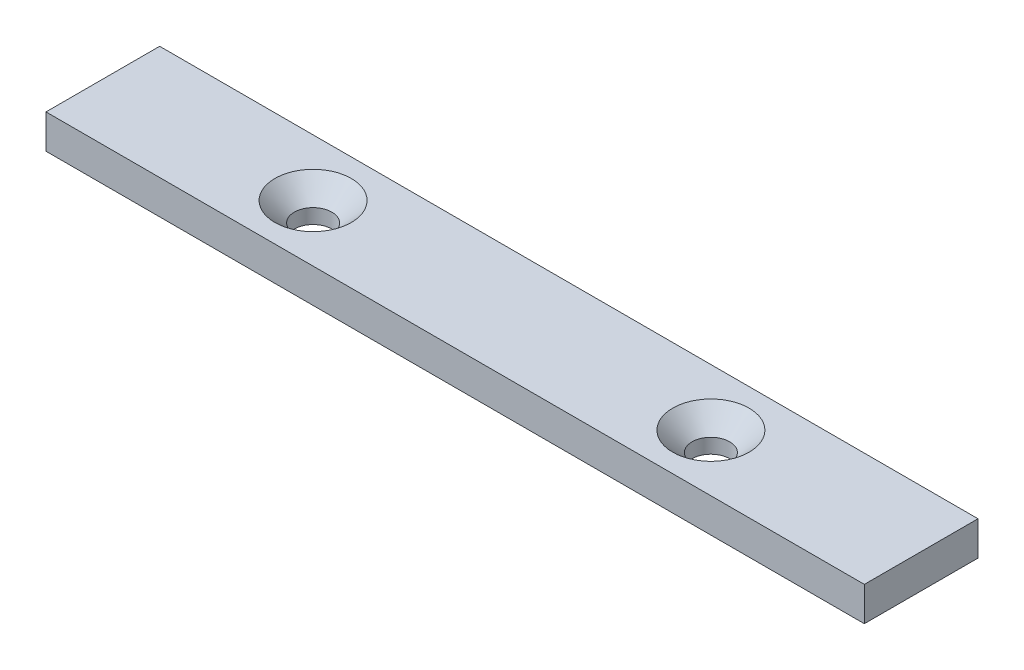
ISO-10303-21;
HEADER;
FILE_DESCRIPTION(('STEP AP214'),'2;1');
FILE_NAME('part.step','',(''),(''),'','','');
FILE_SCHEMA(('AUTOMOTIVE_DESIGN { 1 0 10303 214 1 1 1 1 }'));
ENDSEC;
DATA;
#1=APPLICATION_CONTEXT('core data for automotive mechanical design processes');
#2=APPLICATION_PROTOCOL_DEFINITION('international standard','automotive_design',2000,#1);
#3=PRODUCT_CONTEXT('',#1,'mechanical');
#4=PRODUCT('Part','Part','',(#3));
#5=PRODUCT_RELATED_PRODUCT_CATEGORY('part','',(#4));
#6=PRODUCT_DEFINITION_FORMATION('','',#4);
#7=PRODUCT_DEFINITION_CONTEXT('part definition',#1,'design');
#8=PRODUCT_DEFINITION('design','',#6,#7);
#9=PRODUCT_DEFINITION_SHAPE('','',#8);
#10=(LENGTH_UNIT() NAMED_UNIT(*) SI_UNIT(.MILLI.,.METRE.));
#11=(NAMED_UNIT(*) PLANE_ANGLE_UNIT() SI_UNIT($,.RADIAN.));
#12=(NAMED_UNIT(*) SI_UNIT($,.STERADIAN.) SOLID_ANGLE_UNIT());
#13=UNCERTAINTY_MEASURE_WITH_UNIT(LENGTH_MEASURE(1.E-05),#10,'distance_accuracy_value','');
#14=(GEOMETRIC_REPRESENTATION_CONTEXT(3) GLOBAL_UNCERTAINTY_ASSIGNED_CONTEXT((#13)) GLOBAL_UNIT_ASSIGNED_CONTEXT((#10,
#11,#12)) REPRESENTATION_CONTEXT('',''));
#15=CARTESIAN_POINT('',(0.,0.,0.));
#16=DIRECTION('',(0.,0.,1.));
#17=DIRECTION('',(1.,0.,0.));
#18=AXIS2_PLACEMENT_3D('',#15,#16,#17);
#19=CARTESIAN_POINT('',(72.,6.,-10.));
#20=DIRECTION('',(-1.,0.,0.));
#21=DIRECTION('',(0.,0.,1.));
#22=AXIS2_PLACEMENT_3D('',#19,#20,#21);
#23=PLANE('',#22);
#24=DIRECTION('',(0.,0.,-1.));
#25=VECTOR('',#24,1.);
#26=CARTESIAN_POINT('',(72.,0.,-10.));
#27=LINE('',#26,#25);
#28=CARTESIAN_POINT('',(72.,0.,9.99999999999999));
#29=VERTEX_POINT('',#28);
#30=CARTESIAN_POINT('',(72.,0.,-10.));
#31=VERTEX_POINT('',#30);
#32=EDGE_CURVE('E94',#29,#31,#27,.T.);
#33=ORIENTED_EDGE('',*,*,#32,.T.);
#34=DIRECTION('',(0.,-1.,0.));
#35=VECTOR('',#34,1.);
#36=CARTESIAN_POINT('',(72.,6.,-10.));
#37=LINE('',#36,#35);
#38=CARTESIAN_POINT('',(72.,6.,-10.));
#39=VERTEX_POINT('',#38);
#40=EDGE_CURVE('E11',#39,#31,#37,.T.);
#41=ORIENTED_EDGE('',*,*,#40,.F.);
#42=DIRECTION('',(0.,0.,-1.));
#43=VECTOR('',#42,1.);
#44=CARTESIAN_POINT('',(72.,6.,-10.));
#45=LINE('',#44,#43);
#46=CARTESIAN_POINT('',(72.,6.,9.99999999999999));
#47=VERTEX_POINT('',#46);
#48=EDGE_CURVE('E82',#47,#39,#45,.T.);
#49=ORIENTED_EDGE('',*,*,#48,.F.);
#50=DIRECTION('',(0.,-1.,0.));
#51=VECTOR('',#50,1.);
#52=CARTESIAN_POINT('',(72.,6.,9.99999999999999));
#53=LINE('',#52,#51);
#54=EDGE_CURVE('E90',#47,#29,#53,.T.);
#55=ORIENTED_EDGE('',*,*,#54,.T.);
#56=EDGE_LOOP('',(#33,#41,#49,#55));
#57=FACE_BOUND('',#56,.T.);
#58=ADVANCED_FACE('F31',(#57),#23,.F.);
#59=CARTESIAN_POINT('',(-72.,6.,-9.99999999999999));
#60=DIRECTION('',(0.,0.,1.));
#61=DIRECTION('',(1.,0.,0.));
#62=AXIS2_PLACEMENT_3D('',#59,#60,#61);
#63=PLANE('',#62);
#64=DIRECTION('',(-1.,0.,0.));
#65=VECTOR('',#64,1.);
#66=CARTESIAN_POINT('',(-72.,0.,-9.99999999999999));
#67=LINE('',#66,#65);
#68=CARTESIAN_POINT('',(-72.,0.,-9.99999999999999));
#69=VERTEX_POINT('',#68);
#70=EDGE_CURVE('E86',#31,#69,#67,.T.);
#71=ORIENTED_EDGE('',*,*,#70,.T.);
#72=DIRECTION('',(0.,-1.,0.));
#73=VECTOR('',#72,1.);
#74=CARTESIAN_POINT('',(-72.,6.,-9.99999999999999));
#75=LINE('',#74,#73);
#76=CARTESIAN_POINT('',(-72.,6.,-9.99999999999999));
#77=VERTEX_POINT('',#76);
#78=EDGE_CURVE('E39',#77,#69,#75,.T.);
#79=ORIENTED_EDGE('',*,*,#78,.F.);
#80=DIRECTION('',(-1.,0.,0.));
#81=VECTOR('',#80,1.);
#82=CARTESIAN_POINT('',(-72.,6.,-9.99999999999999));
#83=LINE('',#82,#81);
#84=EDGE_CURVE('E77',#39,#77,#83,.T.);
#85=ORIENTED_EDGE('',*,*,#84,.F.);
#86=ORIENTED_EDGE('',*,*,#40,.T.);
#87=EDGE_LOOP('',(#71,#79,#85,#86));
#88=FACE_BOUND('',#87,.T.);
#89=ADVANCED_FACE('F85',(#88),#63,.F.);
#90=CARTESIAN_POINT('',(-72.,6.,10.));
#91=DIRECTION('',(1.,0.,0.));
#92=DIRECTION('',(0.,0.,-1.));
#93=AXIS2_PLACEMENT_3D('',#90,#91,#92);
#94=PLANE('',#93);
#95=DIRECTION('',(0.,0.,1.));
#96=VECTOR('',#95,1.);
#97=CARTESIAN_POINT('',(-72.,0.,10.));
#98=LINE('',#97,#96);
#99=CARTESIAN_POINT('',(-72.,0.,10.));
#100=VERTEX_POINT('',#99);
#101=EDGE_CURVE('E64',#69,#100,#98,.T.);
#102=ORIENTED_EDGE('',*,*,#101,.T.);
#103=DIRECTION('',(0.,-1.,0.));
#104=VECTOR('',#103,1.);
#105=CARTESIAN_POINT('',(-72.,6.,10.));
#106=LINE('',#105,#104);
#107=CARTESIAN_POINT('',(-72.,6.,10.));
#108=VERTEX_POINT('',#107);
#109=EDGE_CURVE('E87',#108,#100,#106,.T.);
#110=ORIENTED_EDGE('',*,*,#109,.F.);
#111=DIRECTION('',(0.,0.,1.));
#112=VECTOR('',#111,1.);
#113=CARTESIAN_POINT('',(-72.,6.,10.));
#114=LINE('',#113,#112);
#115=EDGE_CURVE('E80',#77,#108,#114,.T.);
#116=ORIENTED_EDGE('',*,*,#115,.F.);
#117=ORIENTED_EDGE('',*,*,#78,.T.);
#118=EDGE_LOOP('',(#102,#110,#116,#117));
#119=FACE_BOUND('',#118,.T.);
#120=ADVANCED_FACE('F88',(#119),#94,.F.);
#121=CARTESIAN_POINT('',(-72.,6.,10.));
#122=DIRECTION('',(0.,0.,-1.));
#123=DIRECTION('',(-1.,0.,0.));
#124=AXIS2_PLACEMENT_3D('',#121,#122,#123);
#125=PLANE('',#124);
#126=DIRECTION('',(1.,0.,0.));
#127=VECTOR('',#126,1.);
#128=CARTESIAN_POINT('',(-72.,0.,10.));
#129=LINE('',#128,#127);
#130=EDGE_CURVE('E70',#100,#29,#129,.T.);
#131=ORIENTED_EDGE('',*,*,#130,.T.);
#132=ORIENTED_EDGE('',*,*,#54,.F.);
#133=DIRECTION('',(1.,0.,0.));
#134=VECTOR('',#133,1.);
#135=CARTESIAN_POINT('',(-72.,6.,10.));
#136=LINE('',#135,#134);
#137=EDGE_CURVE('E47',#108,#47,#136,.T.);
#138=ORIENTED_EDGE('',*,*,#137,.F.);
#139=ORIENTED_EDGE('',*,*,#109,.T.);
#140=EDGE_LOOP('',(#131,#132,#138,#139));
#141=FACE_BOUND('',#140,.T.);
#142=ADVANCED_FACE('F102',(#141),#125,.F.);
#143=CARTESIAN_POINT('',(72.,6.,9.99999999999999));
#144=DIRECTION('',(0.,1.,0.));
#145=DIRECTION('',(0.,0.,1.));
#146=AXIS2_PLACEMENT_3D('',#143,#144,#145);
#147=PLANE('',#146);
#148=CARTESIAN_POINT('',(-35.,6.,0.));
#149=DIRECTION('',(0.,1.,0.));
#150=DIRECTION('',(0.,0.,1.));
#151=AXIS2_PLACEMENT_3D('',#148,#149,#150);
#152=CIRCLE('',#151,6.72);
#153=CARTESIAN_POINT('',(-35.,6.,6.72));
#154=VERTEX_POINT('',#153);
#155=EDGE_CURVE('E122',#154,#154,#152,.T.);
#156=ORIENTED_EDGE('',*,*,#155,.F.);
#157=EDGE_LOOP('',(#156));
#158=FACE_BOUND('',#157,.T.);
#159=CARTESIAN_POINT('',(35.,6.,0.));
#160=DIRECTION('',(0.,1.,0.));
#161=DIRECTION('',(0.,0.,1.));
#162=AXIS2_PLACEMENT_3D('',#159,#160,#161);
#163=CIRCLE('',#162,6.72);
#164=CARTESIAN_POINT('',(35.,6.,6.72));
#165=VERTEX_POINT('',#164);
#166=EDGE_CURVE('E113',#165,#165,#163,.T.);
#167=ORIENTED_EDGE('',*,*,#166,.F.);
#168=EDGE_LOOP('',(#167));
#169=FACE_BOUND('',#168,.T.);
#170=ORIENTED_EDGE('',*,*,#48,.T.);
#171=ORIENTED_EDGE('',*,*,#84,.T.);
#172=ORIENTED_EDGE('',*,*,#115,.T.);
#173=ORIENTED_EDGE('',*,*,#137,.T.);
#174=EDGE_LOOP('',(#170,#171,#172,#173));
#175=FACE_BOUND('',#174,.T.);
#176=ADVANCED_FACE('F78',(#158,#169,#175),#147,.T.);
#177=CARTESIAN_POINT('',(72.,0.,9.99999999999999));
#178=DIRECTION('',(0.,1.,0.));
#179=DIRECTION('',(0.,0.,1.));
#180=AXIS2_PLACEMENT_3D('',#177,#178,#179);
#181=PLANE('',#180);
#182=CARTESIAN_POINT('',(-35.,0.,0.));
#183=DIRECTION('',(0.,1.,0.));
#184=DIRECTION('',(0.,0.,1.));
#185=AXIS2_PLACEMENT_3D('',#182,#183,#184);
#186=CIRCLE('',#185,3.3);
#187=CARTESIAN_POINT('',(-35.,0.,3.3));
#188=VERTEX_POINT('',#187);
#189=EDGE_CURVE('E116',#188,#188,#186,.T.);
#190=ORIENTED_EDGE('',*,*,#189,.T.);
#191=EDGE_LOOP('',(#190));
#192=FACE_BOUND('',#191,.T.);
#193=CARTESIAN_POINT('',(35.,0.,0.));
#194=DIRECTION('',(0.,1.,0.));
#195=DIRECTION('',(0.,0.,1.));
#196=AXIS2_PLACEMENT_3D('',#193,#194,#195);
#197=CIRCLE('',#196,3.3);
#198=CARTESIAN_POINT('',(35.,0.,3.3));
#199=VERTEX_POINT('',#198);
#200=EDGE_CURVE('E97',#199,#199,#197,.T.);
#201=ORIENTED_EDGE('',*,*,#200,.T.);
#202=EDGE_LOOP('',(#201));
#203=FACE_BOUND('',#202,.T.);
#204=ORIENTED_EDGE('',*,*,#32,.F.);
#205=ORIENTED_EDGE('',*,*,#130,.F.);
#206=ORIENTED_EDGE('',*,*,#101,.F.);
#207=ORIENTED_EDGE('',*,*,#70,.F.);
#208=EDGE_LOOP('',(#204,#205,#206,#207));
#209=FACE_BOUND('',#208,.T.);
#210=ADVANCED_FACE('F105',(#192,#203,#209),#181,.F.);
#211=CARTESIAN_POINT('',(35.,6.,0.));
#212=DIRECTION('',(0.,1.,0.));
#213=DIRECTION('',(0.,0.,1.));
#214=AXIS2_PLACEMENT_3D('',#211,#212,#213);
#215=CYLINDRICAL_SURFACE('',#214,3.3);
#216=ORIENTED_EDGE('',*,*,#200,.F.);
#217=EDGE_LOOP('',(#216));
#218=FACE_BOUND('',#217,.T.);
#219=CARTESIAN_POINT('',(35.,2.58,0.));
#220=DIRECTION('',(0.,1.,0.));
#221=DIRECTION('',(0.,0.,1.));
#222=AXIS2_PLACEMENT_3D('',#219,#220,#221);
#223=CIRCLE('',#222,3.3);
#224=CARTESIAN_POINT('',(35.,2.58,3.3));
#225=VERTEX_POINT('',#224);
#226=EDGE_CURVE('E110',#225,#225,#223,.T.);
#227=ORIENTED_EDGE('',*,*,#226,.T.);
#228=EDGE_LOOP('',(#227));
#229=FACE_BOUND('',#228,.T.);
#230=ADVANCED_FACE('F136',(#218,#229),#215,.F.);
#231=CARTESIAN_POINT('',(35.,6.,0.));
#232=DIRECTION('',(0.,1.,0.));
#233=DIRECTION('',(0.,0.,1.));
#234=AXIS2_PLACEMENT_3D('',#231,#232,#233);
#235=CONICAL_SURFACE('',#234,6.72,0.785398163397449);
#236=ORIENTED_EDGE('',*,*,#226,.F.);
#237=EDGE_LOOP('',(#236));
#238=FACE_BOUND('',#237,.T.);
#239=ORIENTED_EDGE('',*,*,#166,.T.);
#240=EDGE_LOOP('',(#239));
#241=FACE_BOUND('',#240,.T.);
#242=ADVANCED_FACE('F133',(#238,#241),#235,.F.);
#243=CARTESIAN_POINT('',(-35.,6.,0.));
#244=DIRECTION('',(0.,1.,0.));
#245=DIRECTION('',(0.,0.,1.));
#246=AXIS2_PLACEMENT_3D('',#243,#244,#245);
#247=CYLINDRICAL_SURFACE('',#246,3.3);
#248=ORIENTED_EDGE('',*,*,#189,.F.);
#249=EDGE_LOOP('',(#248));
#250=FACE_BOUND('',#249,.T.);
#251=CARTESIAN_POINT('',(-35.,2.58,0.));
#252=DIRECTION('',(0.,1.,0.));
#253=DIRECTION('',(0.,0.,1.));
#254=AXIS2_PLACEMENT_3D('',#251,#252,#253);
#255=CIRCLE('',#254,3.3);
#256=CARTESIAN_POINT('',(-35.,2.58,3.3));
#257=VERTEX_POINT('',#256);
#258=EDGE_CURVE('E119',#257,#257,#255,.T.);
#259=ORIENTED_EDGE('',*,*,#258,.T.);
#260=EDGE_LOOP('',(#259));
#261=FACE_BOUND('',#260,.T.);
#262=ADVANCED_FACE('F135',(#250,#261),#247,.F.);
#263=CARTESIAN_POINT('',(-35.,6.,0.));
#264=DIRECTION('',(0.,1.,0.));
#265=DIRECTION('',(0.,0.,1.));
#266=AXIS2_PLACEMENT_3D('',#263,#264,#265);
#267=CONICAL_SURFACE('',#266,6.72,0.785398163397448);
#268=ORIENTED_EDGE('',*,*,#258,.F.);
#269=EDGE_LOOP('',(#268));
#270=FACE_BOUND('',#269,.T.);
#271=ORIENTED_EDGE('',*,*,#155,.T.);
#272=EDGE_LOOP('',(#271));
#273=FACE_BOUND('',#272,.T.);
#274=ADVANCED_FACE('F126',(#270,#273),#267,.F.);
#275=CLOSED_SHELL('',(#58,#89,#120,#142,#176,#210,#230,#242,#262,#274));
#276=MANIFOLD_SOLID_BREP('B2',#275);
#277=ADVANCED_BREP_SHAPE_REPRESENTATION('',(#18,#276),#14);
#278=SHAPE_DEFINITION_REPRESENTATION(#9,#277);
ENDSEC;
END-ISO-10303-21;
